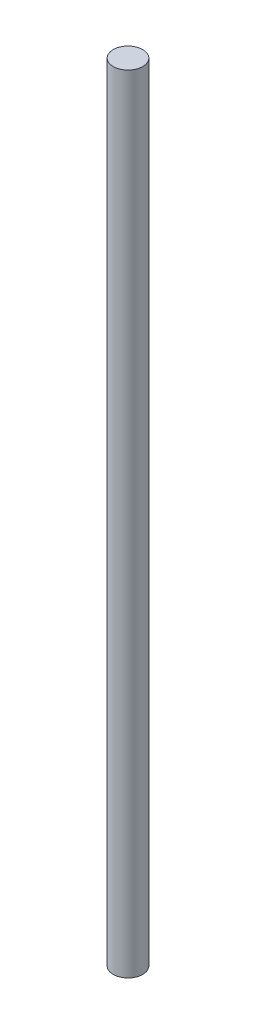
ISO-10303-21;
HEADER;
FILE_DESCRIPTION(('STEP AP214'),'2;1');
FILE_NAME('part.step','',(''),(''),'','','');
FILE_SCHEMA(('AUTOMOTIVE_DESIGN { 1 0 10303 214 1 1 1 1 }'));
ENDSEC;
DATA;
#1=APPLICATION_CONTEXT('core data for automotive mechanical design processes');
#2=APPLICATION_PROTOCOL_DEFINITION('international standard','automotive_design',2000,#1);
#3=PRODUCT_CONTEXT('',#1,'mechanical');
#4=PRODUCT('Part','Part','',(#3));
#5=PRODUCT_RELATED_PRODUCT_CATEGORY('part','',(#4));
#6=PRODUCT_DEFINITION_FORMATION('','',#4);
#7=PRODUCT_DEFINITION_CONTEXT('part definition',#1,'design');
#8=PRODUCT_DEFINITION('design','',#6,#7);
#9=PRODUCT_DEFINITION_SHAPE('','',#8);
#10=(LENGTH_UNIT() NAMED_UNIT(*) SI_UNIT(.MILLI.,.METRE.));
#11=(NAMED_UNIT(*) PLANE_ANGLE_UNIT() SI_UNIT($,.RADIAN.));
#12=(NAMED_UNIT(*) SI_UNIT($,.STERADIAN.) SOLID_ANGLE_UNIT());
#13=UNCERTAINTY_MEASURE_WITH_UNIT(LENGTH_MEASURE(1.E-05),#10,'distance_accuracy_value','');
#14=(GEOMETRIC_REPRESENTATION_CONTEXT(3) GLOBAL_UNCERTAINTY_ASSIGNED_CONTEXT((#13)) GLOBAL_UNIT_ASSIGNED_CONTEXT((#10,
#11,#12)) REPRESENTATION_CONTEXT('',''));
#15=CARTESIAN_POINT('',(0.,0.,0.));
#16=DIRECTION('',(0.,0.,1.));
#17=DIRECTION('',(1.,0.,0.));
#18=AXIS2_PLACEMENT_3D('',#15,#16,#17);
#19=CARTESIAN_POINT('',(0.,254.,0.));
#20=DIRECTION('',(0.,-1.,0.));
#21=DIRECTION('',(0.,0.,-1.));
#22=AXIS2_PLACEMENT_3D('',#19,#20,#21);
#23=CYLINDRICAL_SURFACE('',#22,4.7625);
#24=CARTESIAN_POINT('',(0.,254.,0.));
#25=DIRECTION('',(0.,1.,0.));
#26=DIRECTION('',(0.,0.,1.));
#27=AXIS2_PLACEMENT_3D('',#24,#25,#26);
#28=CIRCLE('',#27,4.7625);
#29=CARTESIAN_POINT('',(0.,254.,4.7625));
#30=VERTEX_POINT('',#29);
#31=EDGE_CURVE('E10',#30,#30,#28,.T.);
#32=ORIENTED_EDGE('',*,*,#31,.F.);
#33=EDGE_LOOP('',(#32));
#34=FACE_BOUND('',#33,.T.);
#35=CARTESIAN_POINT('',(0.,0.,0.));
#36=DIRECTION('',(0.,1.,0.));
#37=DIRECTION('',(0.,0.,1.));
#38=AXIS2_PLACEMENT_3D('',#35,#36,#37);
#39=CIRCLE('',#38,4.7625);
#40=CARTESIAN_POINT('',(0.,0.,4.7625));
#41=VERTEX_POINT('',#40);
#42=EDGE_CURVE('E34',#41,#41,#39,.T.);
#43=ORIENTED_EDGE('',*,*,#42,.T.);
#44=EDGE_LOOP('',(#43));
#45=FACE_BOUND('',#44,.T.);
#46=ADVANCED_FACE('F31',(#34,#45),#23,.T.);
#47=CARTESIAN_POINT('',(0.,254.,0.));
#48=DIRECTION('',(0.,1.,0.));
#49=DIRECTION('',(0.,0.,1.));
#50=AXIS2_PLACEMENT_3D('',#47,#48,#49);
#51=PLANE('',#50);
#52=ORIENTED_EDGE('',*,*,#31,.T.);
#53=EDGE_LOOP('',(#52));
#54=FACE_BOUND('',#53,.T.);
#55=ADVANCED_FACE('F46',(#54),#51,.T.);
#56=CARTESIAN_POINT('',(0.,0.,0.));
#57=DIRECTION('',(0.,1.,0.));
#58=DIRECTION('',(0.,0.,1.));
#59=AXIS2_PLACEMENT_3D('',#56,#57,#58);
#60=PLANE('',#59);
#61=ORIENTED_EDGE('',*,*,#42,.F.);
#62=EDGE_LOOP('',(#61));
#63=FACE_BOUND('',#62,.T.);
#64=ADVANCED_FACE('F44',(#63),#60,.F.);
#65=CLOSED_SHELL('',(#46,#55,#64));
#66=MANIFOLD_SOLID_BREP('B2',#65);
#67=ADVANCED_BREP_SHAPE_REPRESENTATION('',(#18,#66),#14);
#68=SHAPE_DEFINITION_REPRESENTATION(#9,#67);
ENDSEC;
END-ISO-10303-21;
